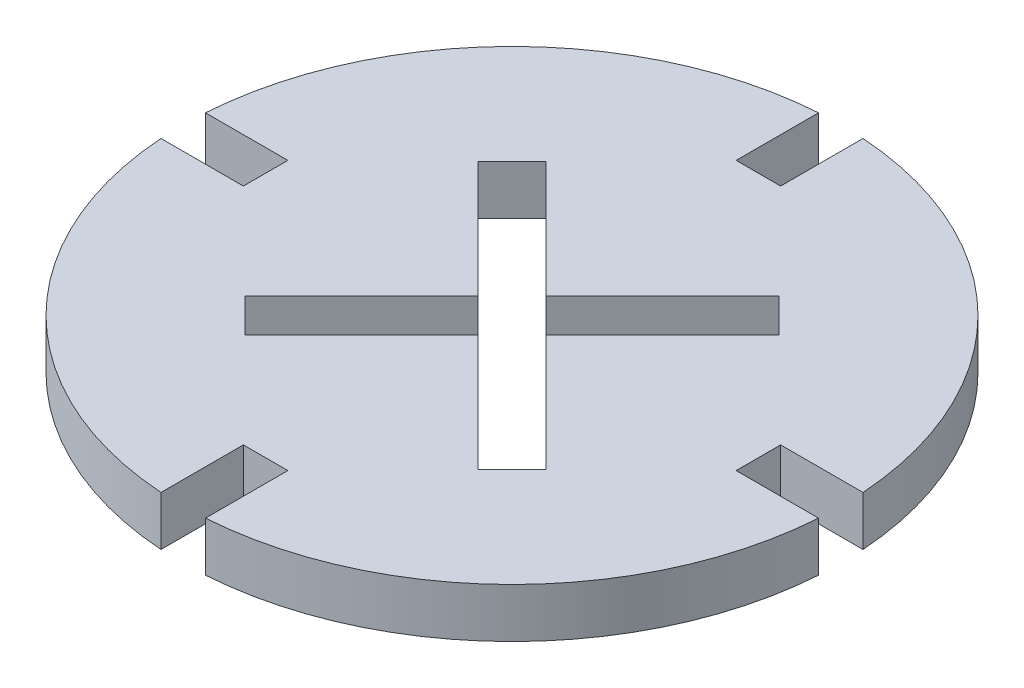
ISO-10303-21;
HEADER;
FILE_DESCRIPTION(('STEP AP214'),'2;1');
FILE_NAME('part.step','',(''),(''),'','','');
FILE_SCHEMA(('AUTOMOTIVE_DESIGN { 1 0 10303 214 1 1 1 1 }'));
ENDSEC;
DATA;
#1=APPLICATION_CONTEXT('core data for automotive mechanical design processes');
#2=APPLICATION_PROTOCOL_DEFINITION('international standard','automotive_design',2000,#1);
#3=PRODUCT_CONTEXT('',#1,'mechanical');
#4=PRODUCT('Part','Part','',(#3));
#5=PRODUCT_RELATED_PRODUCT_CATEGORY('part','',(#4));
#6=PRODUCT_DEFINITION_FORMATION('','',#4);
#7=PRODUCT_DEFINITION_CONTEXT('part definition',#1,'design');
#8=PRODUCT_DEFINITION('design','',#6,#7);
#9=PRODUCT_DEFINITION_SHAPE('','',#8);
#10=(LENGTH_UNIT() NAMED_UNIT(*) SI_UNIT(.MILLI.,.METRE.));
#11=(NAMED_UNIT(*) PLANE_ANGLE_UNIT() SI_UNIT($,.RADIAN.));
#12=(NAMED_UNIT(*) SI_UNIT($,.STERADIAN.) SOLID_ANGLE_UNIT());
#13=UNCERTAINTY_MEASURE_WITH_UNIT(LENGTH_MEASURE(1.E-05),#10,'distance_accuracy_value','');
#14=(GEOMETRIC_REPRESENTATION_CONTEXT(3) GLOBAL_UNCERTAINTY_ASSIGNED_CONTEXT((#13)) GLOBAL_UNIT_ASSIGNED_CONTEXT((#10,
#11,#12)) REPRESENTATION_CONTEXT('',''));
#15=CARTESIAN_POINT('',(0.,0.,0.));
#16=DIRECTION('',(0.,0.,1.));
#17=DIRECTION('',(1.,0.,0.));
#18=AXIS2_PLACEMENT_3D('',#15,#16,#17);
#19=CARTESIAN_POINT('',(-19.9543854828957,3.,1.35));
#20=DIRECTION('',(0.,0.,1.));
#21=DIRECTION('',(1.,0.,0.));
#22=AXIS2_PLACEMENT_3D('',#19,#20,#21);
#23=PLANE('',#22);
#24=DIRECTION('',(-1.,0.,0.));
#25=VECTOR('',#24,1.);
#26=CARTESIAN_POINT('',(-19.9543854828957,0.,1.35));
#27=LINE('',#26,#25);
#28=CARTESIAN_POINT('',(-14.9543854828957,0.,1.35));
#29=VERTEX_POINT('',#28);
#30=CARTESIAN_POINT('',(-19.9543854828957,0.,1.35));
#31=VERTEX_POINT('',#30);
#32=EDGE_CURVE('E233',#29,#31,#27,.T.);
#33=ORIENTED_EDGE('',*,*,#32,.T.);
#34=DIRECTION('',(0.,-1.,0.));
#35=VECTOR('',#34,1.);
#36=CARTESIAN_POINT('',(-19.9543854828957,3.,1.35));
#37=LINE('',#36,#35);
#38=CARTESIAN_POINT('',(-19.9543854828957,3.,1.35));
#39=VERTEX_POINT('',#38);
#40=EDGE_CURVE('E11',#39,#31,#37,.T.);
#41=ORIENTED_EDGE('',*,*,#40,.F.);
#42=DIRECTION('',(-1.,0.,0.));
#43=VECTOR('',#42,1.);
#44=CARTESIAN_POINT('',(-19.9543854828957,3.,1.35));
#45=LINE('',#44,#43);
#46=CARTESIAN_POINT('',(-14.9543854828957,3.,1.35));
#47=VERTEX_POINT('',#46);
#48=EDGE_CURVE('E298',#47,#39,#45,.T.);
#49=ORIENTED_EDGE('',*,*,#48,.F.);
#50=DIRECTION('',(0.,-1.,0.));
#51=VECTOR('',#50,1.);
#52=CARTESIAN_POINT('',(-14.9543854828957,3.,1.35));
#53=LINE('',#52,#51);
#54=EDGE_CURVE('E332',#47,#29,#53,.T.);
#55=ORIENTED_EDGE('',*,*,#54,.T.);
#56=EDGE_LOOP('',(#33,#41,#49,#55));
#57=FACE_BOUND('',#56,.T.);
#58=ADVANCED_FACE('F35',(#57),#23,.F.);
#59=CARTESIAN_POINT('',(0.,3.,0.));
#60=DIRECTION('',(0.,-1.,0.));
#61=DIRECTION('',(0.,0.,-1.));
#62=AXIS2_PLACEMENT_3D('',#59,#60,#61);
#63=CYLINDRICAL_SURFACE('',#62,20.);
#64=CARTESIAN_POINT('',(0.,0.,0.));
#65=DIRECTION('',(0.,1.,0.));
#66=DIRECTION('',(0.,0.,-1.));
#67=AXIS2_PLACEMENT_3D('',#64,#65,#66);
#68=CIRCLE('',#67,20.);
#69=CARTESIAN_POINT('',(-1.35,0.,19.9543854828957));
#70=VERTEX_POINT('',#69);
#71=EDGE_CURVE('E335',#31,#70,#68,.T.);
#72=ORIENTED_EDGE('',*,*,#71,.T.);
#73=DIRECTION('',(0.,-1.,0.));
#74=VECTOR('',#73,1.);
#75=CARTESIAN_POINT('',(-1.35,3.,19.9543854828957));
#76=LINE('',#75,#74);
#77=CARTESIAN_POINT('',(-1.35,3.,19.9543854828957));
#78=VERTEX_POINT('',#77);
#79=EDGE_CURVE('E42',#78,#70,#76,.T.);
#80=ORIENTED_EDGE('',*,*,#79,.F.);
#81=CARTESIAN_POINT('',(0.,3.,0.));
#82=DIRECTION('',(0.,1.,0.));
#83=DIRECTION('',(0.,0.,-1.));
#84=AXIS2_PLACEMENT_3D('',#81,#82,#83);
#85=CIRCLE('',#84,20.);
#86=EDGE_CURVE('E301',#39,#78,#85,.T.);
#87=ORIENTED_EDGE('',*,*,#86,.F.);
#88=ORIENTED_EDGE('',*,*,#40,.T.);
#89=EDGE_LOOP('',(#72,#80,#87,#88));
#90=FACE_BOUND('',#89,.T.);
#91=ADVANCED_FACE('F430',(#90),#63,.T.);
#92=CARTESIAN_POINT('',(-1.35,3.,14.9543854828957));
#93=DIRECTION('',(-1.,0.,0.));
#94=DIRECTION('',(0.,0.,1.));
#95=AXIS2_PLACEMENT_3D('',#92,#93,#94);
#96=PLANE('',#95);
#97=DIRECTION('',(0.,0.,-1.));
#98=VECTOR('',#97,1.);
#99=CARTESIAN_POINT('',(-1.35,0.,14.9543854828957));
#100=LINE('',#99,#98);
#101=CARTESIAN_POINT('',(-1.35,0.,14.9543854828957));
#102=VERTEX_POINT('',#101);
#103=EDGE_CURVE('E337',#70,#102,#100,.T.);
#104=ORIENTED_EDGE('',*,*,#103,.T.);
#105=DIRECTION('',(0.,-1.,0.));
#106=VECTOR('',#105,1.);
#107=CARTESIAN_POINT('',(-1.35,3.,14.9543854828957));
#108=LINE('',#107,#106);
#109=CARTESIAN_POINT('',(-1.35,3.,14.9543854828957));
#110=VERTEX_POINT('',#109);
#111=EDGE_CURVE('E402',#110,#102,#108,.T.);
#112=ORIENTED_EDGE('',*,*,#111,.F.);
#113=DIRECTION('',(0.,0.,-1.));
#114=VECTOR('',#113,1.);
#115=CARTESIAN_POINT('',(-1.35,3.,14.9543854828957));
#116=LINE('',#115,#114);
#117=EDGE_CURVE('E304',#78,#110,#116,.T.);
#118=ORIENTED_EDGE('',*,*,#117,.F.);
#119=ORIENTED_EDGE('',*,*,#79,.T.);
#120=EDGE_LOOP('',(#104,#112,#118,#119));
#121=FACE_BOUND('',#120,.T.);
#122=ADVANCED_FACE('F409',(#121),#96,.F.);
#123=CARTESIAN_POINT('',(1.35000000000001,3.,14.9543854828957));
#124=DIRECTION('',(0.,0.,-1.));
#125=DIRECTION('',(-1.,0.,0.));
#126=AXIS2_PLACEMENT_3D('',#123,#124,#125);
#127=PLANE('',#126);
#128=DIRECTION('',(1.,0.,0.));
#129=VECTOR('',#128,1.);
#130=CARTESIAN_POINT('',(1.35000000000001,0.,14.9543854828957));
#131=LINE('',#130,#129);
#132=CARTESIAN_POINT('',(1.35000000000001,0.,14.9543854828957));
#133=VERTEX_POINT('',#132);
#134=EDGE_CURVE('E339',#102,#133,#131,.T.);
#135=ORIENTED_EDGE('',*,*,#134,.T.);
#136=DIRECTION('',(0.,-1.,0.));
#137=VECTOR('',#136,1.);
#138=CARTESIAN_POINT('',(1.35000000000001,3.,14.9543854828957));
#139=LINE('',#138,#137);
#140=CARTESIAN_POINT('',(1.35000000000001,3.,14.9543854828957));
#141=VERTEX_POINT('',#140);
#142=EDGE_CURVE('E399',#141,#133,#139,.T.);
#143=ORIENTED_EDGE('',*,*,#142,.F.);
#144=DIRECTION('',(1.,0.,0.));
#145=VECTOR('',#144,1.);
#146=CARTESIAN_POINT('',(1.35000000000001,3.,14.9543854828957));
#147=LINE('',#146,#145);
#148=EDGE_CURVE('E306',#110,#141,#147,.T.);
#149=ORIENTED_EDGE('',*,*,#148,.F.);
#150=ORIENTED_EDGE('',*,*,#111,.T.);
#151=EDGE_LOOP('',(#135,#143,#149,#150));
#152=FACE_BOUND('',#151,.T.);
#153=ADVANCED_FACE('F418',(#152),#127,.F.);
#154=CARTESIAN_POINT('',(1.35000000000001,3.,14.9543854828957));
#155=DIRECTION('',(1.,0.,0.));
#156=DIRECTION('',(0.,0.,-1.));
#157=AXIS2_PLACEMENT_3D('',#154,#155,#156);
#158=PLANE('',#157);
#159=DIRECTION('',(0.,0.,1.));
#160=VECTOR('',#159,1.);
#161=CARTESIAN_POINT('',(1.35000000000001,0.,14.9543854828957));
#162=LINE('',#161,#160);
#163=CARTESIAN_POINT('',(1.35000000000001,0.,19.9543854828957));
#164=VERTEX_POINT('',#163);
#165=EDGE_CURVE('E341',#133,#164,#162,.T.);
#166=ORIENTED_EDGE('',*,*,#165,.T.);
#167=DIRECTION('',(0.,-1.,0.));
#168=VECTOR('',#167,1.);
#169=CARTESIAN_POINT('',(1.35000000000001,3.,19.9543854828957));
#170=LINE('',#169,#168);
#171=CARTESIAN_POINT('',(1.35000000000001,3.,19.9543854828957));
#172=VERTEX_POINT('',#171);
#173=EDGE_CURVE('E396',#172,#164,#170,.T.);
#174=ORIENTED_EDGE('',*,*,#173,.F.);
#175=DIRECTION('',(0.,0.,1.));
#176=VECTOR('',#175,1.);
#177=CARTESIAN_POINT('',(1.35000000000001,3.,14.9543854828957));
#178=LINE('',#177,#176);
#179=EDGE_CURVE('E308',#141,#172,#178,.T.);
#180=ORIENTED_EDGE('',*,*,#179,.F.);
#181=ORIENTED_EDGE('',*,*,#142,.T.);
#182=EDGE_LOOP('',(#166,#174,#180,#181));
#183=FACE_BOUND('',#182,.T.);
#184=ADVANCED_FACE('F422',(#183),#158,.F.);
#185=CARTESIAN_POINT('',(0.,3.,0.));
#186=DIRECTION('',(0.,-1.,0.));
#187=DIRECTION('',(0.,0.,-1.));
#188=AXIS2_PLACEMENT_3D('',#185,#186,#187);
#189=CYLINDRICAL_SURFACE('',#188,20.);
#190=CARTESIAN_POINT('',(0.,0.,0.));
#191=DIRECTION('',(0.,1.,0.));
#192=DIRECTION('',(0.,0.,1.));
#193=AXIS2_PLACEMENT_3D('',#190,#191,#192);
#194=CIRCLE('',#193,20.);
#195=CARTESIAN_POINT('',(19.9543854828957,0.,1.34999999999999));
#196=VERTEX_POINT('',#195);
#197=EDGE_CURVE('E343',#164,#196,#194,.T.);
#198=ORIENTED_EDGE('',*,*,#197,.T.);
#199=DIRECTION('',(0.,-1.,0.));
#200=VECTOR('',#199,1.);
#201=CARTESIAN_POINT('',(19.9543854828957,3.,1.34999999999999));
#202=LINE('',#201,#200);
#203=CARTESIAN_POINT('',(19.9543854828957,3.,1.34999999999999));
#204=VERTEX_POINT('',#203);
#205=EDGE_CURVE('E393',#204,#196,#202,.T.);
#206=ORIENTED_EDGE('',*,*,#205,.F.);
#207=CARTESIAN_POINT('',(0.,3.,0.));
#208=DIRECTION('',(0.,1.,0.));
#209=DIRECTION('',(0.,0.,1.));
#210=AXIS2_PLACEMENT_3D('',#207,#208,#209);
#211=CIRCLE('',#210,20.);
#212=EDGE_CURVE('E310',#172,#204,#211,.T.);
#213=ORIENTED_EDGE('',*,*,#212,.F.);
#214=ORIENTED_EDGE('',*,*,#173,.T.);
#215=EDGE_LOOP('',(#198,#206,#213,#214));
#216=FACE_BOUND('',#215,.T.);
#217=ADVANCED_FACE('F483',(#216),#189,.T.);
#218=CARTESIAN_POINT('',(19.9543854828957,3.,1.34999999999999));
#219=DIRECTION('',(0.,0.,1.));
#220=DIRECTION('',(1.,0.,0.));
#221=AXIS2_PLACEMENT_3D('',#218,#219,#220);
#222=PLANE('',#221);
#223=DIRECTION('',(-1.,0.,0.));
#224=VECTOR('',#223,1.);
#225=CARTESIAN_POINT('',(19.9543854828957,0.,1.34999999999999));
#226=LINE('',#225,#224);
#227=CARTESIAN_POINT('',(14.9543854828957,0.,1.35));
#228=VERTEX_POINT('',#227);
#229=EDGE_CURVE('E345',#196,#228,#226,.T.);
#230=ORIENTED_EDGE('',*,*,#229,.T.);
#231=DIRECTION('',(0.,-1.,0.));
#232=VECTOR('',#231,1.);
#233=CARTESIAN_POINT('',(14.9543854828957,3.,1.35));
#234=LINE('',#233,#232);
#235=CARTESIAN_POINT('',(14.9543854828957,3.,1.35));
#236=VERTEX_POINT('',#235);
#237=EDGE_CURVE('E390',#236,#228,#234,.T.);
#238=ORIENTED_EDGE('',*,*,#237,.F.);
#239=DIRECTION('',(-1.,0.,0.));
#240=VECTOR('',#239,1.);
#241=CARTESIAN_POINT('',(19.9543854828957,3.,1.34999999999999));
#242=LINE('',#241,#240);
#243=EDGE_CURVE('E312',#204,#236,#242,.T.);
#244=ORIENTED_EDGE('',*,*,#243,.F.);
#245=ORIENTED_EDGE('',*,*,#205,.T.);
#246=EDGE_LOOP('',(#230,#238,#244,#245));
#247=FACE_BOUND('',#246,.T.);
#248=ADVANCED_FACE('F480',(#247),#222,.F.);
#249=CARTESIAN_POINT('',(14.9543854828957,3.,-1.35));
#250=DIRECTION('',(-1.,0.,0.));
#251=DIRECTION('',(0.,0.,1.));
#252=AXIS2_PLACEMENT_3D('',#249,#250,#251);
#253=PLANE('',#252);
#254=DIRECTION('',(0.,0.,-1.));
#255=VECTOR('',#254,1.);
#256=CARTESIAN_POINT('',(14.9543854828957,0.,-1.35));
#257=LINE('',#256,#255);
#258=CARTESIAN_POINT('',(14.9543854828957,0.,-1.35));
#259=VERTEX_POINT('',#258);
#260=EDGE_CURVE('E347',#228,#259,#257,.T.);
#261=ORIENTED_EDGE('',*,*,#260,.T.);
#262=DIRECTION('',(0.,-1.,0.));
#263=VECTOR('',#262,1.);
#264=CARTESIAN_POINT('',(14.9543854828957,3.,-1.35));
#265=LINE('',#264,#263);
#266=CARTESIAN_POINT('',(14.9543854828957,3.,-1.35));
#267=VERTEX_POINT('',#266);
#268=EDGE_CURVE('E387',#267,#259,#265,.T.);
#269=ORIENTED_EDGE('',*,*,#268,.F.);
#270=DIRECTION('',(0.,0.,-1.));
#271=VECTOR('',#270,1.);
#272=CARTESIAN_POINT('',(14.9543854828957,3.,-1.35));
#273=LINE('',#272,#271);
#274=EDGE_CURVE('E314',#236,#267,#273,.T.);
#275=ORIENTED_EDGE('',*,*,#274,.F.);
#276=ORIENTED_EDGE('',*,*,#237,.T.);
#277=EDGE_LOOP('',(#261,#269,#275,#276));
#278=FACE_BOUND('',#277,.T.);
#279=ADVANCED_FACE('F476',(#278),#253,.F.);
#280=CARTESIAN_POINT('',(19.9543854828957,3.,-1.34999999999999));
#281=DIRECTION('',(0.,0.,-1.));
#282=DIRECTION('',(-1.,0.,0.));
#283=AXIS2_PLACEMENT_3D('',#280,#281,#282);
#284=PLANE('',#283);
#285=DIRECTION('',(1.,0.,0.));
#286=VECTOR('',#285,1.);
#287=CARTESIAN_POINT('',(19.9543854828957,0.,-1.34999999999999));
#288=LINE('',#287,#286);
#289=CARTESIAN_POINT('',(19.9543854828957,0.,-1.34999999999999));
#290=VERTEX_POINT('',#289);
#291=EDGE_CURVE('E349',#259,#290,#288,.T.);
#292=ORIENTED_EDGE('',*,*,#291,.T.);
#293=DIRECTION('',(0.,-1.,0.));
#294=VECTOR('',#293,1.);
#295=CARTESIAN_POINT('',(19.9543854828957,3.,-1.34999999999999));
#296=LINE('',#295,#294);
#297=CARTESIAN_POINT('',(19.9543854828957,3.,-1.34999999999999));
#298=VERTEX_POINT('',#297);
#299=EDGE_CURVE('E384',#298,#290,#296,.T.);
#300=ORIENTED_EDGE('',*,*,#299,.F.);
#301=DIRECTION('',(1.,0.,0.));
#302=VECTOR('',#301,1.);
#303=CARTESIAN_POINT('',(19.9543854828957,3.,-1.34999999999999));
#304=LINE('',#303,#302);
#305=EDGE_CURVE('E316',#267,#298,#304,.T.);
#306=ORIENTED_EDGE('',*,*,#305,.F.);
#307=ORIENTED_EDGE('',*,*,#268,.T.);
#308=EDGE_LOOP('',(#292,#300,#306,#307));
#309=FACE_BOUND('',#308,.T.);
#310=ADVANCED_FACE('F472',(#309),#284,.F.);
#311=CARTESIAN_POINT('',(0.,3.,0.));
#312=DIRECTION('',(0.,-1.,0.));
#313=DIRECTION('',(0.,0.,-1.));
#314=AXIS2_PLACEMENT_3D('',#311,#312,#313);
#315=CYLINDRICAL_SURFACE('',#314,20.);
#316=CARTESIAN_POINT('',(0.,0.,0.));
#317=DIRECTION('',(0.,1.,0.));
#318=DIRECTION('',(0.,0.,-1.));
#319=AXIS2_PLACEMENT_3D('',#316,#317,#318);
#320=CIRCLE('',#319,20.);
#321=CARTESIAN_POINT('',(1.35000000000001,0.,-19.9543854828957));
#322=VERTEX_POINT('',#321);
#323=EDGE_CURVE('E351',#290,#322,#320,.T.);
#324=ORIENTED_EDGE('',*,*,#323,.T.);
#325=DIRECTION('',(0.,-1.,0.));
#326=VECTOR('',#325,1.);
#327=CARTESIAN_POINT('',(1.35000000000001,3.,-19.9543854828957));
#328=LINE('',#327,#326);
#329=CARTESIAN_POINT('',(1.35000000000001,3.,-19.9543854828957));
#330=VERTEX_POINT('',#329);
#331=EDGE_CURVE('E381',#330,#322,#328,.T.);
#332=ORIENTED_EDGE('',*,*,#331,.F.);
#333=CARTESIAN_POINT('',(0.,3.,0.));
#334=DIRECTION('',(0.,1.,0.));
#335=DIRECTION('',(0.,0.,-1.));
#336=AXIS2_PLACEMENT_3D('',#333,#334,#335);
#337=CIRCLE('',#336,20.);
#338=EDGE_CURVE('E318',#298,#330,#337,.T.);
#339=ORIENTED_EDGE('',*,*,#338,.F.);
#340=ORIENTED_EDGE('',*,*,#299,.T.);
#341=EDGE_LOOP('',(#324,#332,#339,#340));
#342=FACE_BOUND('',#341,.T.);
#343=ADVANCED_FACE('F467',(#342),#315,.T.);
#344=CARTESIAN_POINT('',(1.35000000000001,3.,-14.9543854828957));
#345=DIRECTION('',(1.,0.,0.));
#346=DIRECTION('',(0.,0.,-1.));
#347=AXIS2_PLACEMENT_3D('',#344,#345,#346);
#348=PLANE('',#347);
#349=DIRECTION('',(0.,0.,1.));
#350=VECTOR('',#349,1.);
#351=CARTESIAN_POINT('',(1.35000000000001,0.,-14.9543854828957));
#352=LINE('',#351,#350);
#353=CARTESIAN_POINT('',(1.35000000000001,0.,-14.9543854828957));
#354=VERTEX_POINT('',#353);
#355=EDGE_CURVE('E353',#322,#354,#352,.T.);
#356=ORIENTED_EDGE('',*,*,#355,.T.);
#357=DIRECTION('',(0.,-1.,0.));
#358=VECTOR('',#357,1.);
#359=CARTESIAN_POINT('',(1.35000000000001,3.,-14.9543854828957));
#360=LINE('',#359,#358);
#361=CARTESIAN_POINT('',(1.35000000000001,3.,-14.9543854828957));
#362=VERTEX_POINT('',#361);
#363=EDGE_CURVE('E378',#362,#354,#360,.T.);
#364=ORIENTED_EDGE('',*,*,#363,.F.);
#365=DIRECTION('',(0.,0.,1.));
#366=VECTOR('',#365,1.);
#367=CARTESIAN_POINT('',(1.35000000000001,3.,-14.9543854828957));
#368=LINE('',#367,#366);
#369=EDGE_CURVE('E320',#330,#362,#368,.T.);
#370=ORIENTED_EDGE('',*,*,#369,.F.);
#371=ORIENTED_EDGE('',*,*,#331,.T.);
#372=EDGE_LOOP('',(#356,#364,#370,#371));
#373=FACE_BOUND('',#372,.T.);
#374=ADVANCED_FACE('F461',(#373),#348,.F.);
#375=CARTESIAN_POINT('',(1.35000000000001,3.,-14.9543854828957));
#376=DIRECTION('',(0.,0.,1.));
#377=DIRECTION('',(1.,0.,0.));
#378=AXIS2_PLACEMENT_3D('',#375,#376,#377);
#379=PLANE('',#378);
#380=DIRECTION('',(-1.,0.,0.));
#381=VECTOR('',#380,1.);
#382=CARTESIAN_POINT('',(1.35000000000001,0.,-14.9543854828957));
#383=LINE('',#382,#381);
#384=CARTESIAN_POINT('',(-1.35,0.,-14.9543854828957));
#385=VERTEX_POINT('',#384);
#386=EDGE_CURVE('E355',#354,#385,#383,.T.);
#387=ORIENTED_EDGE('',*,*,#386,.T.);
#388=DIRECTION('',(0.,-1.,0.));
#389=VECTOR('',#388,1.);
#390=CARTESIAN_POINT('',(-1.35,3.,-14.9543854828957));
#391=LINE('',#390,#389);
#392=CARTESIAN_POINT('',(-1.35,3.,-14.9543854828957));
#393=VERTEX_POINT('',#392);
#394=EDGE_CURVE('E375',#393,#385,#391,.T.);
#395=ORIENTED_EDGE('',*,*,#394,.F.);
#396=DIRECTION('',(-1.,0.,0.));
#397=VECTOR('',#396,1.);
#398=CARTESIAN_POINT('',(1.35000000000001,3.,-14.9543854828957));
#399=LINE('',#398,#397);
#400=EDGE_CURVE('E322',#362,#393,#399,.T.);
#401=ORIENTED_EDGE('',*,*,#400,.F.);
#402=ORIENTED_EDGE('',*,*,#363,.T.);
#403=EDGE_LOOP('',(#387,#395,#401,#402));
#404=FACE_BOUND('',#403,.T.);
#405=ADVANCED_FACE('F457',(#404),#379,.F.);
#406=CARTESIAN_POINT('',(-1.35,3.,-14.9543854828957));
#407=DIRECTION('',(-1.,0.,0.));
#408=DIRECTION('',(0.,0.,1.));
#409=AXIS2_PLACEMENT_3D('',#406,#407,#408);
#410=PLANE('',#409);
#411=DIRECTION('',(0.,0.,-1.));
#412=VECTOR('',#411,1.);
#413=CARTESIAN_POINT('',(-1.35,0.,-14.9543854828957));
#414=LINE('',#413,#412);
#415=CARTESIAN_POINT('',(-1.34999999999999,0.,-19.9543854828957));
#416=VERTEX_POINT('',#415);
#417=EDGE_CURVE('E357',#385,#416,#414,.T.);
#418=ORIENTED_EDGE('',*,*,#417,.T.);
#419=DIRECTION('',(0.,-1.,0.));
#420=VECTOR('',#419,1.);
#421=CARTESIAN_POINT('',(-1.34999999999999,3.,-19.9543854828957));
#422=LINE('',#421,#420);
#423=CARTESIAN_POINT('',(-1.34999999999999,3.,-19.9543854828957));
#424=VERTEX_POINT('',#423);
#425=EDGE_CURVE('E372',#424,#416,#422,.T.);
#426=ORIENTED_EDGE('',*,*,#425,.F.);
#427=DIRECTION('',(0.,0.,-1.));
#428=VECTOR('',#427,1.);
#429=CARTESIAN_POINT('',(-1.35,3.,-14.9543854828957));
#430=LINE('',#429,#428);
#431=EDGE_CURVE('E324',#393,#424,#430,.T.);
#432=ORIENTED_EDGE('',*,*,#431,.F.);
#433=ORIENTED_EDGE('',*,*,#394,.T.);
#434=EDGE_LOOP('',(#418,#426,#432,#433));
#435=FACE_BOUND('',#434,.T.);
#436=ADVANCED_FACE('F452',(#435),#410,.F.);
#437=CARTESIAN_POINT('',(0.,3.,0.));
#438=DIRECTION('',(0.,-1.,0.));
#439=DIRECTION('',(0.,0.,-1.));
#440=AXIS2_PLACEMENT_3D('',#437,#438,#439);
#441=CYLINDRICAL_SURFACE('',#440,20.);
#442=CARTESIAN_POINT('',(0.,0.,0.));
#443=DIRECTION('',(0.,1.,0.));
#444=DIRECTION('',(0.,0.,1.));
#445=AXIS2_PLACEMENT_3D('',#442,#443,#444);
#446=CIRCLE('',#445,20.);
#447=CARTESIAN_POINT('',(-19.9543854828957,0.,-1.35));
#448=VERTEX_POINT('',#447);
#449=EDGE_CURVE('E359',#416,#448,#446,.T.);
#450=ORIENTED_EDGE('',*,*,#449,.T.);
#451=DIRECTION('',(0.,-1.,0.));
#452=VECTOR('',#451,1.);
#453=CARTESIAN_POINT('',(-19.9543854828957,3.,-1.35));
#454=LINE('',#453,#452);
#455=CARTESIAN_POINT('',(-19.9543854828957,3.,-1.35));
#456=VERTEX_POINT('',#455);
#457=EDGE_CURVE('E369',#456,#448,#454,.T.);
#458=ORIENTED_EDGE('',*,*,#457,.F.);
#459=CARTESIAN_POINT('',(0.,3.,0.));
#460=DIRECTION('',(0.,1.,0.));
#461=DIRECTION('',(0.,0.,1.));
#462=AXIS2_PLACEMENT_3D('',#459,#460,#461);
#463=CIRCLE('',#462,20.);
#464=EDGE_CURVE('E326',#424,#456,#463,.T.);
#465=ORIENTED_EDGE('',*,*,#464,.F.);
#466=ORIENTED_EDGE('',*,*,#425,.T.);
#467=EDGE_LOOP('',(#450,#458,#465,#466));
#468=FACE_BOUND('',#467,.T.);
#469=ADVANCED_FACE('F446',(#468),#441,.T.);
#470=CARTESIAN_POINT('',(-19.9543854828957,3.,-1.35));
#471=DIRECTION('',(0.,0.,-1.));
#472=DIRECTION('',(-1.,0.,0.));
#473=AXIS2_PLACEMENT_3D('',#470,#471,#472);
#474=PLANE('',#473);
#475=DIRECTION('',(1.,0.,0.));
#476=VECTOR('',#475,1.);
#477=CARTESIAN_POINT('',(-19.9543854828957,0.,-1.35));
#478=LINE('',#477,#476);
#479=CARTESIAN_POINT('',(-14.9543854828957,0.,-1.35));
#480=VERTEX_POINT('',#479);
#481=EDGE_CURVE('E361',#448,#480,#478,.T.);
#482=ORIENTED_EDGE('',*,*,#481,.T.);
#483=DIRECTION('',(0.,-1.,0.));
#484=VECTOR('',#483,1.);
#485=CARTESIAN_POINT('',(-14.9543854828957,3.,-1.35));
#486=LINE('',#485,#484);
#487=CARTESIAN_POINT('',(-14.9543854828957,3.,-1.35));
#488=VERTEX_POINT('',#487);
#489=EDGE_CURVE('E366',#488,#480,#486,.T.);
#490=ORIENTED_EDGE('',*,*,#489,.F.);
#491=DIRECTION('',(1.,0.,0.));
#492=VECTOR('',#491,1.);
#493=CARTESIAN_POINT('',(-19.9543854828957,3.,-1.35));
#494=LINE('',#493,#492);
#495=EDGE_CURVE('E328',#456,#488,#494,.T.);
#496=ORIENTED_EDGE('',*,*,#495,.F.);
#497=ORIENTED_EDGE('',*,*,#457,.T.);
#498=EDGE_LOOP('',(#482,#490,#496,#497));
#499=FACE_BOUND('',#498,.T.);
#500=ADVANCED_FACE('F442',(#499),#474,.F.);
#501=CARTESIAN_POINT('',(-14.9543854828957,3.,-1.35));
#502=DIRECTION('',(1.,0.,0.));
#503=DIRECTION('',(0.,0.,-1.));
#504=AXIS2_PLACEMENT_3D('',#501,#502,#503);
#505=PLANE('',#504);
#506=DIRECTION('',(0.,0.,1.));
#507=VECTOR('',#506,1.);
#508=CARTESIAN_POINT('',(-14.9543854828957,0.,-1.35));
#509=LINE('',#508,#507);
#510=EDGE_CURVE('E302',#480,#29,#509,.T.);
#511=ORIENTED_EDGE('',*,*,#510,.T.);
#512=ORIENTED_EDGE('',*,*,#54,.F.);
#513=DIRECTION('',(0.,0.,1.));
#514=VECTOR('',#513,1.);
#515=CARTESIAN_POINT('',(-14.9543854828957,3.,-1.35));
#516=LINE('',#515,#514);
#517=EDGE_CURVE('E330',#488,#47,#516,.T.);
#518=ORIENTED_EDGE('',*,*,#517,.F.);
#519=ORIENTED_EDGE('',*,*,#489,.T.);
#520=EDGE_LOOP('',(#511,#512,#518,#519));
#521=FACE_BOUND('',#520,.T.);
#522=ADVANCED_FACE('F437',(#521),#505,.F.);
#523=CARTESIAN_POINT('',(0.,3.,0.));
#524=DIRECTION('',(0.,1.,0.));
#525=DIRECTION('',(0.,0.,1.));
#526=AXIS2_PLACEMENT_3D('',#523,#524,#525);
#527=PLANE('',#526);
#528=DIRECTION('',(-0.707106781186547,0.,-0.707106781186548));
#529=VECTOR('',#528,1.);
#530=CARTESIAN_POINT('',(0.,3.,-2.05060966544098));
#531=LINE('',#530,#529);
#532=CARTESIAN_POINT('',(0.,3.,-2.05060966544098));
#533=VERTEX_POINT('',#532);
#534=CARTESIAN_POINT('',(-7.07106781186547,3.,-9.12167747730646));
#535=VERTEX_POINT('',#534);
#536=EDGE_CURVE('E49',#533,#535,#531,.T.);
#537=ORIENTED_EDGE('',*,*,#536,.F.);
#538=DIRECTION('',(-0.707106781186548,0.,0.707106781186548));
#539=VECTOR('',#538,1.);
#540=CARTESIAN_POINT('',(0.,3.,-2.05060966544098));
#541=LINE('',#540,#539);
#542=CARTESIAN_POINT('',(7.07106781186547,3.,-9.12167747730645));
#543=VERTEX_POINT('',#542);
#544=EDGE_CURVE('E227',#543,#533,#541,.T.);
#545=ORIENTED_EDGE('',*,*,#544,.F.);
#546=DIRECTION('',(-0.707106781186545,0.,-0.70710678118655));
#547=VECTOR('',#546,1.);
#548=CARTESIAN_POINT('',(7.07106781186547,3.,-9.12167747730645));
#549=LINE('',#548,#547);
#550=CARTESIAN_POINT('',(9.12167747730646,3.,-7.07106781186546));
#551=VERTEX_POINT('',#550);
#552=EDGE_CURVE('E273',#551,#543,#549,.T.);
#553=ORIENTED_EDGE('',*,*,#552,.F.);
#554=DIRECTION('',(0.707106781186548,0.,-0.707106781186547));
#555=VECTOR('',#554,1.);
#556=CARTESIAN_POINT('',(2.05060966544099,3.,0.));
#557=LINE('',#556,#555);
#558=CARTESIAN_POINT('',(2.05060966544099,3.,0.));
#559=VERTEX_POINT('',#558);
#560=EDGE_CURVE('E270',#559,#551,#557,.T.);
#561=ORIENTED_EDGE('',*,*,#560,.F.);
#562=DIRECTION('',(-0.707106781186548,0.,-0.707106781186547));
#563=VECTOR('',#562,1.);
#564=CARTESIAN_POINT('',(2.05060966544099,3.,0.));
#565=LINE('',#564,#563);
#566=CARTESIAN_POINT('',(9.12167747730647,3.,7.07106781186548));
#567=VERTEX_POINT('',#566);
#568=EDGE_CURVE('E267',#567,#559,#565,.T.);
#569=ORIENTED_EDGE('',*,*,#568,.F.);
#570=DIRECTION('',(0.707106781186547,0.,-0.707106781186548));
#571=VECTOR('',#570,1.);
#572=CARTESIAN_POINT('',(7.07106781186548,3.,9.12167747730647));
#573=LINE('',#572,#571);
#574=CARTESIAN_POINT('',(7.07106781186548,3.,9.12167747730647));
#575=VERTEX_POINT('',#574);
#576=EDGE_CURVE('E264',#575,#567,#573,.T.);
#577=ORIENTED_EDGE('',*,*,#576,.F.);
#578=DIRECTION('',(0.707106781186547,0.,0.707106781186548));
#579=VECTOR('',#578,1.);
#580=CARTESIAN_POINT('',(0.,3.,2.05060966544098));
#581=LINE('',#580,#579);
#582=CARTESIAN_POINT('',(0.,3.,2.05060966544098));
#583=VERTEX_POINT('',#582);
#584=EDGE_CURVE('E261',#583,#575,#581,.T.);
#585=ORIENTED_EDGE('',*,*,#584,.F.);
#586=DIRECTION('',(0.707106781186547,0.,-0.707106781186548));
#587=VECTOR('',#586,1.);
#588=CARTESIAN_POINT('',(0.,3.,2.05060966544098));
#589=LINE('',#588,#587);
#590=CARTESIAN_POINT('',(-7.07106781186546,3.,9.12167747730646));
#591=VERTEX_POINT('',#590);
#592=EDGE_CURVE('E258',#591,#583,#589,.T.);
#593=ORIENTED_EDGE('',*,*,#592,.F.);
#594=DIRECTION('',(0.707106781186547,0.,0.707106781186547));
#595=VECTOR('',#594,1.);
#596=CARTESIAN_POINT('',(-9.12167747730645,3.,7.07106781186547));
#597=LINE('',#596,#595);
#598=CARTESIAN_POINT('',(-9.12167747730645,3.,7.07106781186547));
#599=VERTEX_POINT('',#598);
#600=EDGE_CURVE('E255',#599,#591,#597,.T.);
#601=ORIENTED_EDGE('',*,*,#600,.F.);
#602=DIRECTION('',(-0.707106781186547,0.,0.707106781186547));
#603=VECTOR('',#602,1.);
#604=CARTESIAN_POINT('',(-2.05060966544097,3.,0.));
#605=LINE('',#604,#603);
#606=CARTESIAN_POINT('',(-2.05060966544097,3.,0.));
#607=VERTEX_POINT('',#606);
#608=EDGE_CURVE('E252',#607,#599,#605,.T.);
#609=ORIENTED_EDGE('',*,*,#608,.F.);
#610=DIRECTION('',(0.707106781186548,0.,0.707106781186547));
#611=VECTOR('',#610,1.);
#612=CARTESIAN_POINT('',(-2.05060966544097,3.,0.));
#613=LINE('',#612,#611);
#614=CARTESIAN_POINT('',(-9.12167747730646,3.,-7.07106781186547));
#615=VERTEX_POINT('',#614);
#616=EDGE_CURVE('E249',#615,#607,#613,.T.);
#617=ORIENTED_EDGE('',*,*,#616,.F.);
#618=DIRECTION('',(-0.707106781186548,0.,0.707106781186547));
#619=VECTOR('',#618,1.);
#620=CARTESIAN_POINT('',(-9.12167747730646,3.,-7.07106781186547));
#621=LINE('',#620,#619);
#622=EDGE_CURVE('E242',#535,#615,#621,.T.);
#623=ORIENTED_EDGE('',*,*,#622,.F.);
#624=EDGE_LOOP('',(#537,#545,#553,#561,#569,#577,#585,#593,#601,#609,#617,#623));
#625=FACE_BOUND('',#624,.T.);
#626=ORIENTED_EDGE('',*,*,#48,.T.);
#627=ORIENTED_EDGE('',*,*,#86,.T.);
#628=ORIENTED_EDGE('',*,*,#117,.T.);
#629=ORIENTED_EDGE('',*,*,#148,.T.);
#630=ORIENTED_EDGE('',*,*,#179,.T.);
#631=ORIENTED_EDGE('',*,*,#212,.T.);
#632=ORIENTED_EDGE('',*,*,#243,.T.);
#633=ORIENTED_EDGE('',*,*,#274,.T.);
#634=ORIENTED_EDGE('',*,*,#305,.T.);
#635=ORIENTED_EDGE('',*,*,#338,.T.);
#636=ORIENTED_EDGE('',*,*,#369,.T.);
#637=ORIENTED_EDGE('',*,*,#400,.T.);
#638=ORIENTED_EDGE('',*,*,#431,.T.);
#639=ORIENTED_EDGE('',*,*,#464,.T.);
#640=ORIENTED_EDGE('',*,*,#495,.T.);
#641=ORIENTED_EDGE('',*,*,#517,.T.);
#642=EDGE_LOOP('',(#626,#627,#628,#629,#630,#631,#632,#633,#634,#635,#636,#637,#638,#639,#640,#641));
#643=FACE_BOUND('',#642,.T.);
#644=ADVANCED_FACE('F426',(#625,#643),#527,.T.);
#645=CARTESIAN_POINT('',(0.,0.,0.));
#646=DIRECTION('',(0.,1.,0.));
#647=DIRECTION('',(0.,0.,1.));
#648=AXIS2_PLACEMENT_3D('',#645,#646,#647);
#649=PLANE('',#648);
#650=DIRECTION('',(0.707106781186548,0.,-0.707106781186548));
#651=VECTOR('',#650,1.);
#652=CARTESIAN_POINT('',(0.,0.,-2.05060966544098));
#653=LINE('',#652,#651);
#654=CARTESIAN_POINT('',(0.,0.,-2.05060966544098));
#655=VERTEX_POINT('',#654);
#656=CARTESIAN_POINT('',(7.07106781186547,0.,-9.12167747730645));
#657=VERTEX_POINT('',#656);
#658=EDGE_CURVE('E240',#655,#657,#653,.T.);
#659=ORIENTED_EDGE('',*,*,#658,.F.);
#660=DIRECTION('',(0.707106781186547,0.,0.707106781186548));
#661=VECTOR('',#660,1.);
#662=CARTESIAN_POINT('',(0.,0.,-2.05060966544098));
#663=LINE('',#662,#661);
#664=CARTESIAN_POINT('',(-7.07106781186547,0.,-9.12167747730646));
#665=VERTEX_POINT('',#664);
#666=EDGE_CURVE('E221',#665,#655,#663,.T.);
#667=ORIENTED_EDGE('',*,*,#666,.F.);
#668=DIRECTION('',(0.707106781186548,0.,-0.707106781186547));
#669=VECTOR('',#668,1.);
#670=CARTESIAN_POINT('',(-9.12167747730646,0.,-7.07106781186547));
#671=LINE('',#670,#669);
#672=CARTESIAN_POINT('',(-9.12167747730645,0.,-7.07106781186547));
#673=VERTEX_POINT('',#672);
#674=EDGE_CURVE('E230',#673,#665,#671,.T.);
#675=ORIENTED_EDGE('',*,*,#674,.F.);
#676=DIRECTION('',(-0.707106781186548,0.,-0.707106781186547));
#677=VECTOR('',#676,1.);
#678=CARTESIAN_POINT('',(-2.05060966544097,0.,0.));
#679=LINE('',#678,#677);
#680=CARTESIAN_POINT('',(-2.05060966544097,0.,0.));
#681=VERTEX_POINT('',#680);
#682=EDGE_CURVE('E57',#681,#673,#679,.T.);
#683=ORIENTED_EDGE('',*,*,#682,.F.);
#684=DIRECTION('',(0.707106781186548,0.,-0.707106781186548));
#685=VECTOR('',#684,1.);
#686=CARTESIAN_POINT('',(-2.05060966544097,0.,0.));
#687=LINE('',#686,#685);
#688=CARTESIAN_POINT('',(-9.12167747730645,0.,7.07106781186547));
#689=VERTEX_POINT('',#688);
#690=EDGE_CURVE('E730',#689,#681,#687,.T.);
#691=ORIENTED_EDGE('',*,*,#690,.F.);
#692=DIRECTION('',(-0.707106781186548,0.,-0.707106781186548));
#693=VECTOR('',#692,1.);
#694=CARTESIAN_POINT('',(-9.12167747730645,0.,7.07106781186547));
#695=LINE('',#694,#693);
#696=CARTESIAN_POINT('',(-7.07106781186546,0.,9.12167747730646));
#697=VERTEX_POINT('',#696);
#698=EDGE_CURVE('E733',#697,#689,#695,.T.);
#699=ORIENTED_EDGE('',*,*,#698,.F.);
#700=DIRECTION('',(-0.707106781186547,0.,0.707106781186548));
#701=VECTOR('',#700,1.);
#702=CARTESIAN_POINT('',(0.,0.,2.05060966544098));
#703=LINE('',#702,#701);
#704=CARTESIAN_POINT('',(0.,0.,2.05060966544098));
#705=VERTEX_POINT('',#704);
#706=EDGE_CURVE('E738',#705,#697,#703,.T.);
#707=ORIENTED_EDGE('',*,*,#706,.F.);
#708=DIRECTION('',(-0.707106781186547,0.,-0.707106781186548));
#709=VECTOR('',#708,1.);
#710=CARTESIAN_POINT('',(0.,0.,2.05060966544098));
#711=LINE('',#710,#709);
#712=CARTESIAN_POINT('',(7.07106781186548,0.,9.12167747730647));
#713=VERTEX_POINT('',#712);
#714=EDGE_CURVE('E741',#713,#705,#711,.T.);
#715=ORIENTED_EDGE('',*,*,#714,.F.);
#716=DIRECTION('',(-0.707106781186547,0.,0.707106781186548));
#717=VECTOR('',#716,1.);
#718=CARTESIAN_POINT('',(7.07106781186548,0.,9.12167747730647));
#719=LINE('',#718,#717);
#720=CARTESIAN_POINT('',(9.12167747730647,0.,7.07106781186548));
#721=VERTEX_POINT('',#720);
#722=EDGE_CURVE('E744',#721,#713,#719,.T.);
#723=ORIENTED_EDGE('',*,*,#722,.F.);
#724=DIRECTION('',(0.707106781186548,0.,0.707106781186547));
#725=VECTOR('',#724,1.);
#726=CARTESIAN_POINT('',(2.05060966544099,0.,0.));
#727=LINE('',#726,#725);
#728=CARTESIAN_POINT('',(2.05060966544099,0.,0.));
#729=VERTEX_POINT('',#728);
#730=EDGE_CURVE('E747',#729,#721,#727,.T.);
#731=ORIENTED_EDGE('',*,*,#730,.F.);
#732=DIRECTION('',(-0.707106781186548,0.,0.707106781186547));
#733=VECTOR('',#732,1.);
#734=CARTESIAN_POINT('',(2.05060966544099,0.,0.));
#735=LINE('',#734,#733);
#736=CARTESIAN_POINT('',(9.12167747730646,0.,-7.07106781186546));
#737=VERTEX_POINT('',#736);
#738=EDGE_CURVE('E750',#737,#729,#735,.T.);
#739=ORIENTED_EDGE('',*,*,#738,.F.);
#740=DIRECTION('',(0.707106781186545,0.,0.70710678118655));
#741=VECTOR('',#740,1.);
#742=CARTESIAN_POINT('',(7.07106781186547,0.,-9.12167747730645));
#743=LINE('',#742,#741);
#744=EDGE_CURVE('E244',#657,#737,#743,.T.);
#745=ORIENTED_EDGE('',*,*,#744,.F.);
#746=EDGE_LOOP('',(#659,#667,#675,#683,#691,#699,#707,#715,#723,#731,#739,#745));
#747=FACE_BOUND('',#746,.T.);
#748=ORIENTED_EDGE('',*,*,#32,.F.);
#749=ORIENTED_EDGE('',*,*,#510,.F.);
#750=ORIENTED_EDGE('',*,*,#481,.F.);
#751=ORIENTED_EDGE('',*,*,#449,.F.);
#752=ORIENTED_EDGE('',*,*,#417,.F.);
#753=ORIENTED_EDGE('',*,*,#386,.F.);
#754=ORIENTED_EDGE('',*,*,#355,.F.);
#755=ORIENTED_EDGE('',*,*,#323,.F.);
#756=ORIENTED_EDGE('',*,*,#291,.F.);
#757=ORIENTED_EDGE('',*,*,#260,.F.);
#758=ORIENTED_EDGE('',*,*,#229,.F.);
#759=ORIENTED_EDGE('',*,*,#197,.F.);
#760=ORIENTED_EDGE('',*,*,#165,.F.);
#761=ORIENTED_EDGE('',*,*,#134,.F.);
#762=ORIENTED_EDGE('',*,*,#103,.F.);
#763=ORIENTED_EDGE('',*,*,#71,.F.);
#764=EDGE_LOOP('',(#748,#749,#750,#751,#752,#753,#754,#755,#756,#757,#758,#759,#760,#761,#762,#763));
#765=FACE_BOUND('',#764,.T.);
#766=ADVANCED_FACE('F236',(#747,#765),#649,.F.);
#767=CARTESIAN_POINT('',(0.,-0.00100000000000013,-2.05060966544098));
#768=DIRECTION('',(0.707106781186548,0.,-0.707106781186547));
#769=DIRECTION('',(-0.707106781186547,0.,-0.707106781186548));
#770=AXIS2_PLACEMENT_3D('',#767,#768,#769);
#771=PLANE('',#770);
#772=ORIENTED_EDGE('',*,*,#666,.T.);
#773=DIRECTION('',(0.,1.,0.));
#774=VECTOR('',#773,1.);
#775=CARTESIAN_POINT('',(0.,-0.00100000000000013,-2.05060966544098));
#776=LINE('',#775,#774);
#777=EDGE_CURVE('E234',#655,#533,#776,.T.);
#778=ORIENTED_EDGE('',*,*,#777,.T.);
#779=ORIENTED_EDGE('',*,*,#536,.T.);
#780=DIRECTION('',(0.,1.,0.));
#781=VECTOR('',#780,1.);
#782=CARTESIAN_POINT('',(-7.07106781186547,-0.00100000000000013,-9.12167747730646));
#783=LINE('',#782,#781);
#784=EDGE_CURVE('E217',#665,#535,#783,.T.);
#785=ORIENTED_EDGE('',*,*,#784,.F.);
#786=EDGE_LOOP('',(#772,#778,#779,#785));
#787=FACE_BOUND('',#786,.T.);
#788=ADVANCED_FACE('F219',(#787),#771,.F.);
#789=CARTESIAN_POINT('',(0.,-0.00100000000000013,-2.05060966544098));
#790=DIRECTION('',(-0.707106781186548,0.,-0.707106781186548));
#791=DIRECTION('',(-0.707106781186548,0.,0.707106781186548));
#792=AXIS2_PLACEMENT_3D('',#789,#790,#791);
#793=PLANE('',#792);
#794=ORIENTED_EDGE('',*,*,#658,.T.);
#795=DIRECTION('',(0.,1.,0.));
#796=VECTOR('',#795,1.);
#797=CARTESIAN_POINT('',(7.07106781186547,-0.00100000000000013,-9.12167747730645));
#798=LINE('',#797,#796);
#799=EDGE_CURVE('E279',#657,#543,#798,.T.);
#800=ORIENTED_EDGE('',*,*,#799,.T.);
#801=ORIENTED_EDGE('',*,*,#544,.T.);
#802=ORIENTED_EDGE('',*,*,#777,.F.);
#803=EDGE_LOOP('',(#794,#800,#801,#802));
#804=FACE_BOUND('',#803,.T.);
#805=ADVANCED_FACE('F618',(#804),#793,.F.);
#806=CARTESIAN_POINT('',(7.07106781186547,-0.00100000000000013,-9.12167747730645));
#807=DIRECTION('',(0.70710678118655,0.,-0.707106781186545));
#808=DIRECTION('',(-0.707106781186545,0.,-0.70710678118655));
#809=AXIS2_PLACEMENT_3D('',#806,#807,#808);
#810=PLANE('',#809);
#811=ORIENTED_EDGE('',*,*,#744,.T.);
#812=DIRECTION('',(0.,1.,0.));
#813=VECTOR('',#812,1.);
#814=CARTESIAN_POINT('',(9.12167747730646,-0.00100000000000013,-7.07106781186546));
#815=LINE('',#814,#813);
#816=EDGE_CURVE('E281',#737,#551,#815,.T.);
#817=ORIENTED_EDGE('',*,*,#816,.T.);
#818=ORIENTED_EDGE('',*,*,#552,.T.);
#819=ORIENTED_EDGE('',*,*,#799,.F.);
#820=EDGE_LOOP('',(#811,#817,#818,#819));
#821=FACE_BOUND('',#820,.T.);
#822=ADVANCED_FACE('F627',(#821),#810,.F.);
#823=CARTESIAN_POINT('',(2.05060966544099,-0.00100000000000013,0.));
#824=DIRECTION('',(0.707106781186547,0.,0.707106781186548));
#825=DIRECTION('',(0.707106781186548,0.,-0.707106781186547));
#826=AXIS2_PLACEMENT_3D('',#823,#824,#825);
#827=PLANE('',#826);
#828=ORIENTED_EDGE('',*,*,#738,.T.);
#829=DIRECTION('',(0.,1.,0.));
#830=VECTOR('',#829,1.);
#831=CARTESIAN_POINT('',(2.05060966544099,-0.00100000000000013,0.));
#832=LINE('',#831,#830);
#833=EDGE_CURVE('E283',#729,#559,#832,.T.);
#834=ORIENTED_EDGE('',*,*,#833,.T.);
#835=ORIENTED_EDGE('',*,*,#560,.T.);
#836=ORIENTED_EDGE('',*,*,#816,.F.);
#837=EDGE_LOOP('',(#828,#834,#835,#836));
#838=FACE_BOUND('',#837,.T.);
#839=ADVANCED_FACE('F637',(#838),#827,.F.);
#840=CARTESIAN_POINT('',(2.05060966544099,-0.00100000000000013,0.));
#841=DIRECTION('',(0.707106781186547,0.,-0.707106781186548));
#842=DIRECTION('',(-0.707106781186548,0.,-0.707106781186547));
#843=AXIS2_PLACEMENT_3D('',#840,#841,#842);
#844=PLANE('',#843);
#845=ORIENTED_EDGE('',*,*,#730,.T.);
#846=DIRECTION('',(0.,1.,0.));
#847=VECTOR('',#846,1.);
#848=CARTESIAN_POINT('',(9.12167747730647,-0.00100000000000013,7.07106781186548));
#849=LINE('',#848,#847);
#850=EDGE_CURVE('E285',#721,#567,#849,.T.);
#851=ORIENTED_EDGE('',*,*,#850,.T.);
#852=ORIENTED_EDGE('',*,*,#568,.T.);
#853=ORIENTED_EDGE('',*,*,#833,.F.);
#854=EDGE_LOOP('',(#845,#851,#852,#853));
#855=FACE_BOUND('',#854,.T.);
#856=ADVANCED_FACE('F647',(#855),#844,.F.);
#857=CARTESIAN_POINT('',(7.07106781186548,-0.00100000000000013,9.12167747730647));
#858=DIRECTION('',(0.707106781186548,0.,0.707106781186547));
#859=DIRECTION('',(0.707106781186547,0.,-0.707106781186548));
#860=AXIS2_PLACEMENT_3D('',#857,#858,#859);
#861=PLANE('',#860);
#862=ORIENTED_EDGE('',*,*,#722,.T.);
#863=DIRECTION('',(0.,1.,0.));
#864=VECTOR('',#863,1.);
#865=CARTESIAN_POINT('',(7.07106781186548,-0.00100000000000013,9.12167747730647));
#866=LINE('',#865,#864);
#867=EDGE_CURVE('E287',#713,#575,#866,.T.);
#868=ORIENTED_EDGE('',*,*,#867,.T.);
#869=ORIENTED_EDGE('',*,*,#576,.T.);
#870=ORIENTED_EDGE('',*,*,#850,.F.);
#871=EDGE_LOOP('',(#862,#868,#869,#870));
#872=FACE_BOUND('',#871,.T.);
#873=ADVANCED_FACE('F657',(#872),#861,.F.);
#874=CARTESIAN_POINT('',(0.,-0.00100000000000013,2.05060966544098));
#875=DIRECTION('',(-0.707106781186548,0.,0.707106781186547));
#876=DIRECTION('',(0.707106781186547,0.,0.707106781186548));
#877=AXIS2_PLACEMENT_3D('',#874,#875,#876);
#878=PLANE('',#877);
#879=ORIENTED_EDGE('',*,*,#714,.T.);
#880=DIRECTION('',(0.,1.,0.));
#881=VECTOR('',#880,1.);
#882=CARTESIAN_POINT('',(0.,-0.00100000000000013,2.05060966544098));
#883=LINE('',#882,#881);
#884=EDGE_CURVE('E289',#705,#583,#883,.T.);
#885=ORIENTED_EDGE('',*,*,#884,.T.);
#886=ORIENTED_EDGE('',*,*,#584,.T.);
#887=ORIENTED_EDGE('',*,*,#867,.F.);
#888=EDGE_LOOP('',(#879,#885,#886,#887));
#889=FACE_BOUND('',#888,.T.);
#890=ADVANCED_FACE('F667',(#889),#878,.F.);
#891=CARTESIAN_POINT('',(0.,-0.00100000000000013,2.05060966544098));
#892=DIRECTION('',(0.707106781186548,0.,0.707106781186547));
#893=DIRECTION('',(0.707106781186547,0.,-0.707106781186548));
#894=AXIS2_PLACEMENT_3D('',#891,#892,#893);
#895=PLANE('',#894);
#896=ORIENTED_EDGE('',*,*,#706,.T.);
#897=DIRECTION('',(0.,1.,0.));
#898=VECTOR('',#897,1.);
#899=CARTESIAN_POINT('',(-7.07106781186546,-0.00100000000000013,9.12167747730646));
#900=LINE('',#899,#898);
#901=EDGE_CURVE('E291',#697,#591,#900,.T.);
#902=ORIENTED_EDGE('',*,*,#901,.T.);
#903=ORIENTED_EDGE('',*,*,#592,.T.);
#904=ORIENTED_EDGE('',*,*,#884,.F.);
#905=EDGE_LOOP('',(#896,#902,#903,#904));
#906=FACE_BOUND('',#905,.T.);
#907=ADVANCED_FACE('F677',(#906),#895,.F.);
#908=CARTESIAN_POINT('',(-9.12167747730645,-0.00100000000000013,7.07106781186547));
#909=DIRECTION('',(-0.707106781186547,0.,0.707106781186547));
#910=DIRECTION('',(0.707106781186548,0.,0.707106781186548));
#911=AXIS2_PLACEMENT_3D('',#908,#909,#910);
#912=PLANE('',#911);
#913=ORIENTED_EDGE('',*,*,#698,.T.);
#914=DIRECTION('',(0.,1.,0.));
#915=VECTOR('',#914,1.);
#916=CARTESIAN_POINT('',(-9.12167747730645,-0.00100000000000013,7.07106781186547));
#917=LINE('',#916,#915);
#918=EDGE_CURVE('E293',#689,#599,#917,.T.);
#919=ORIENTED_EDGE('',*,*,#918,.T.);
#920=ORIENTED_EDGE('',*,*,#600,.T.);
#921=ORIENTED_EDGE('',*,*,#901,.F.);
#922=EDGE_LOOP('',(#913,#919,#920,#921));
#923=FACE_BOUND('',#922,.T.);
#924=ADVANCED_FACE('F687',(#923),#912,.F.);
#925=CARTESIAN_POINT('',(-2.05060966544097,-0.00100000000000013,0.));
#926=DIRECTION('',(-0.707106781186547,0.,-0.707106781186547));
#927=DIRECTION('',(-0.707106781186548,0.,0.707106781186548));
#928=AXIS2_PLACEMENT_3D('',#925,#926,#927);
#929=PLANE('',#928);
#930=ORIENTED_EDGE('',*,*,#690,.T.);
#931=DIRECTION('',(0.,1.,0.));
#932=VECTOR('',#931,1.);
#933=CARTESIAN_POINT('',(-2.05060966544097,-0.00100000000000013,0.));
#934=LINE('',#933,#932);
#935=EDGE_CURVE('E295',#681,#607,#934,.T.);
#936=ORIENTED_EDGE('',*,*,#935,.T.);
#937=ORIENTED_EDGE('',*,*,#608,.T.);
#938=ORIENTED_EDGE('',*,*,#918,.F.);
#939=EDGE_LOOP('',(#930,#936,#937,#938));
#940=FACE_BOUND('',#939,.T.);
#941=ADVANCED_FACE('F697',(#940),#929,.F.);
#942=CARTESIAN_POINT('',(-2.05060966544097,-0.00100000000000013,0.));
#943=DIRECTION('',(-0.707106781186547,0.,0.707106781186548));
#944=DIRECTION('',(0.707106781186548,0.,0.707106781186547));
#945=AXIS2_PLACEMENT_3D('',#942,#943,#944);
#946=PLANE('',#945);
#947=ORIENTED_EDGE('',*,*,#682,.T.);
#948=DIRECTION('',(0.,1.,0.));
#949=VECTOR('',#948,1.);
#950=CARTESIAN_POINT('',(-9.12167747730646,-0.00100000000000013,-7.07106781186547));
#951=LINE('',#950,#949);
#952=EDGE_CURVE('E226',#673,#615,#951,.T.);
#953=ORIENTED_EDGE('',*,*,#952,.T.);
#954=ORIENTED_EDGE('',*,*,#616,.T.);
#955=ORIENTED_EDGE('',*,*,#935,.F.);
#956=EDGE_LOOP('',(#947,#953,#954,#955));
#957=FACE_BOUND('',#956,.T.);
#958=ADVANCED_FACE('F707',(#957),#946,.F.);
#959=CARTESIAN_POINT('',(-9.12167747730646,-0.00100000000000013,-7.07106781186547));
#960=DIRECTION('',(-0.707106781186547,0.,-0.707106781186548));
#961=DIRECTION('',(-0.707106781186548,0.,0.707106781186547));
#962=AXIS2_PLACEMENT_3D('',#959,#960,#961);
#963=PLANE('',#962);
#964=ORIENTED_EDGE('',*,*,#674,.T.);
#965=ORIENTED_EDGE('',*,*,#784,.T.);
#966=ORIENTED_EDGE('',*,*,#622,.T.);
#967=ORIENTED_EDGE('',*,*,#952,.F.);
#968=EDGE_LOOP('',(#964,#965,#966,#967));
#969=FACE_BOUND('',#968,.T.);
#970=ADVANCED_FACE('F231',(#969),#963,.F.);
#971=CLOSED_SHELL('',(#58,#91,#122,#153,#184,#217,#248,#279,#310,#343,#374,#405,#436,#469,#500,
#522,#644,#766,#788,#805,#822,#839,#856,#873,#890,#907,#924,#941,#958,#970));
#972=MANIFOLD_SOLID_BREP('B2',#971);
#973=ADVANCED_BREP_SHAPE_REPRESENTATION('',(#18,#972),#14);
#974=SHAPE_DEFINITION_REPRESENTATION(#9,#973);
ENDSEC;
END-ISO-10303-21;
